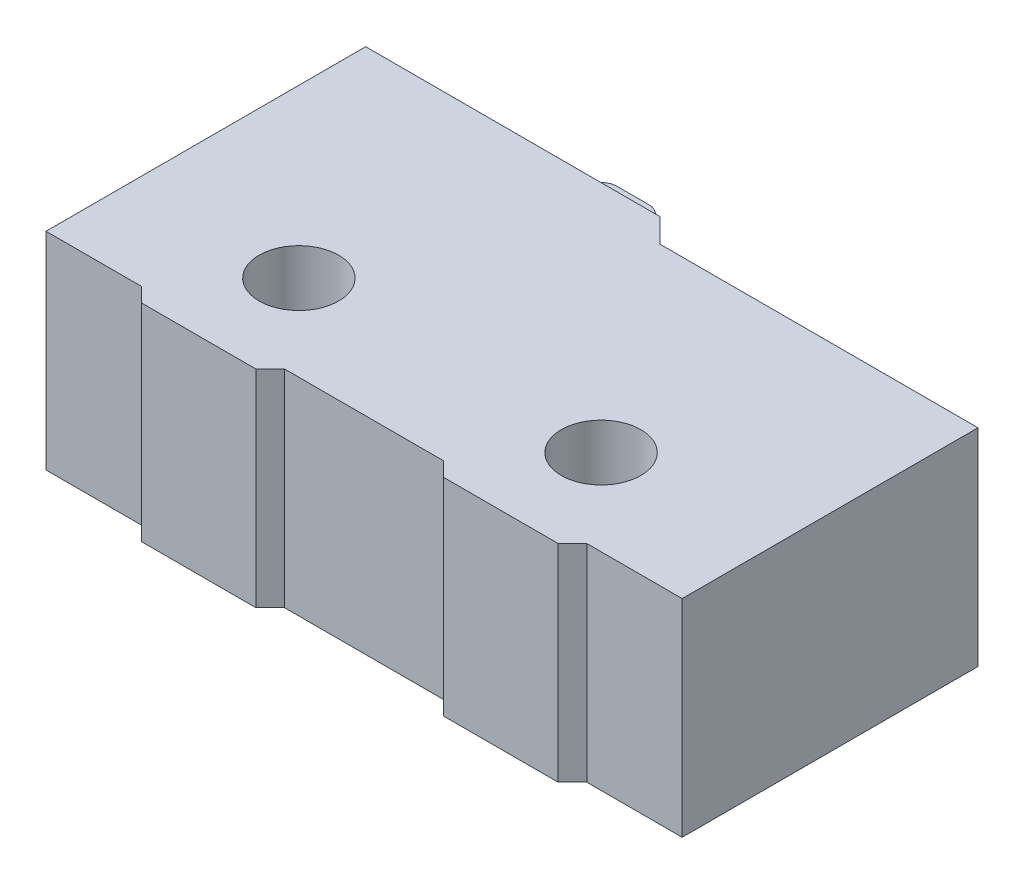
ISO-10303-21;
HEADER;
FILE_DESCRIPTION(('STEP AP214'),'2;1');
FILE_NAME('part.step','',(''),(''),'','','');
FILE_SCHEMA(('AUTOMOTIVE_DESIGN { 1 0 10303 214 1 1 1 1 }'));
ENDSEC;
DATA;
#1=APPLICATION_CONTEXT('core data for automotive mechanical design processes');
#2=APPLICATION_PROTOCOL_DEFINITION('international standard','automotive_design',2000,#1);
#3=PRODUCT_CONTEXT('',#1,'mechanical');
#4=PRODUCT('Part','Part','',(#3));
#5=PRODUCT_RELATED_PRODUCT_CATEGORY('part','',(#4));
#6=PRODUCT_DEFINITION_FORMATION('','',#4);
#7=PRODUCT_DEFINITION_CONTEXT('part definition',#1,'design');
#8=PRODUCT_DEFINITION('design','',#6,#7);
#9=PRODUCT_DEFINITION_SHAPE('','',#8);
#10=(LENGTH_UNIT() NAMED_UNIT(*) SI_UNIT(.MILLI.,.METRE.));
#11=(NAMED_UNIT(*) PLANE_ANGLE_UNIT() SI_UNIT($,.RADIAN.));
#12=(NAMED_UNIT(*) SI_UNIT($,.STERADIAN.) SOLID_ANGLE_UNIT());
#13=UNCERTAINTY_MEASURE_WITH_UNIT(LENGTH_MEASURE(1.E-05),#10,'distance_accuracy_value','');
#14=(GEOMETRIC_REPRESENTATION_CONTEXT(3) GLOBAL_UNCERTAINTY_ASSIGNED_CONTEXT((#13)) GLOBAL_UNIT_ASSIGNED_CONTEXT((#10,
#11,#12)) REPRESENTATION_CONTEXT('',''));
#15=CARTESIAN_POINT('',(0.,0.,0.));
#16=DIRECTION('',(0.,0.,1.));
#17=DIRECTION('',(1.,0.,0.));
#18=AXIS2_PLACEMENT_3D('',#15,#16,#17);
#19=CARTESIAN_POINT('',(-10.,6.5,5.25));
#20=DIRECTION('',(0.,0.,-1.));
#21=DIRECTION('',(-1.,0.,0.));
#22=AXIS2_PLACEMENT_3D('',#19,#20,#21);
#23=PLANE('',#22);
#24=DIRECTION('',(1.,0.,0.));
#25=VECTOR('',#24,1.);
#26=CARTESIAN_POINT('',(-10.,0.,5.25));
#27=LINE('',#26,#25);
#28=CARTESIAN_POINT('',(-6.55,0.,5.25));
#29=VERTEX_POINT('',#28);
#30=CARTESIAN_POINT('',(-2.95,0.,5.25));
#31=VERTEX_POINT('',#30);
#32=EDGE_CURVE('E275',#29,#31,#27,.T.);
#33=ORIENTED_EDGE('',*,*,#32,.T.);
#34=DIRECTION('',(0.,1.,0.));
#35=VECTOR('',#34,1.);
#36=CARTESIAN_POINT('',(-2.95,6.5,5.25));
#37=LINE('',#36,#35);
#38=CARTESIAN_POINT('',(-2.95,6.5,5.25));
#39=VERTEX_POINT('',#38);
#40=EDGE_CURVE('E312',#31,#39,#37,.T.);
#41=ORIENTED_EDGE('',*,*,#40,.T.);
#42=DIRECTION('',(1.,0.,0.));
#43=VECTOR('',#42,1.);
#44=CARTESIAN_POINT('',(-10.,6.5,5.25));
#45=LINE('',#44,#43);
#46=CARTESIAN_POINT('',(-6.55,6.5,5.25));
#47=VERTEX_POINT('',#46);
#48=EDGE_CURVE('E263',#47,#39,#45,.T.);
#49=ORIENTED_EDGE('',*,*,#48,.F.);
#50=DIRECTION('',(0.,-1.,0.));
#51=VECTOR('',#50,1.);
#52=CARTESIAN_POINT('',(-6.55,6.5,5.25));
#53=LINE('',#52,#51);
#54=EDGE_CURVE('E309',#47,#29,#53,.T.);
#55=ORIENTED_EDGE('',*,*,#54,.T.);
#56=EDGE_LOOP('',(#33,#41,#49,#55));
#57=FACE_BOUND('',#56,.T.);
#58=ADVANCED_FACE('F33',(#57),#23,.F.);
#59=CARTESIAN_POINT('',(-10.,6.5,-5.25));
#60=DIRECTION('',(1.,0.,0.));
#61=DIRECTION('',(0.,0.,-1.));
#62=AXIS2_PLACEMENT_3D('',#59,#60,#61);
#63=PLANE('',#62);
#64=DIRECTION('',(0.,0.,1.));
#65=VECTOR('',#64,1.);
#66=CARTESIAN_POINT('',(-10.,0.,-5.25));
#67=LINE('',#66,#65);
#68=CARTESIAN_POINT('',(-10.,0.,-5.25));
#69=VERTEX_POINT('',#68);
#70=CARTESIAN_POINT('',(-10.,0.,4.8));
#71=VERTEX_POINT('',#70);
#72=EDGE_CURVE('E255',#69,#71,#67,.T.);
#73=ORIENTED_EDGE('',*,*,#72,.T.);
#74=DIRECTION('',(0.,1.,0.));
#75=VECTOR('',#74,1.);
#76=CARTESIAN_POINT('',(-10.,6.5,4.8));
#77=LINE('',#76,#75);
#78=CARTESIAN_POINT('',(-10.,6.5,4.8));
#79=VERTEX_POINT('',#78);
#80=EDGE_CURVE('E242',#71,#79,#77,.T.);
#81=ORIENTED_EDGE('',*,*,#80,.T.);
#82=DIRECTION('',(0.,0.,1.));
#83=VECTOR('',#82,1.);
#84=CARTESIAN_POINT('',(-10.,6.5,-5.25));
#85=LINE('',#84,#83);
#86=CARTESIAN_POINT('',(-10.,6.5,-5.25));
#87=VERTEX_POINT('',#86);
#88=EDGE_CURVE('E258',#87,#79,#85,.T.);
#89=ORIENTED_EDGE('',*,*,#88,.F.);
#90=DIRECTION('',(0.,-1.,0.));
#91=VECTOR('',#90,1.);
#92=CARTESIAN_POINT('',(-10.,6.5,-5.25));
#93=LINE('',#92,#91);
#94=EDGE_CURVE('E271',#87,#69,#93,.T.);
#95=ORIENTED_EDGE('',*,*,#94,.T.);
#96=EDGE_LOOP('',(#73,#81,#89,#95));
#97=FACE_BOUND('',#96,.T.);
#98=ADVANCED_FACE('F361',(#97),#63,.F.);
#99=CARTESIAN_POINT('',(2.94999999999886,0.,5.25));
#100=VERTEX_POINT('',#99);
#101=CARTESIAN_POINT('',(6.55,0.,5.25));
#102=VERTEX_POINT('',#101);
#103=EDGE_CURVE('E274',#100,#102,#27,.T.);
#104=ORIENTED_EDGE('',*,*,#103,.T.);
#105=DIRECTION('',(0.,1.,0.));
#106=VECTOR('',#105,1.);
#107=CARTESIAN_POINT('',(6.55,6.5,5.25));
#108=LINE('',#107,#106);
#109=CARTESIAN_POINT('',(6.55,6.5,5.25));
#110=VERTEX_POINT('',#109);
#111=EDGE_CURVE('E290',#102,#110,#108,.T.);
#112=ORIENTED_EDGE('',*,*,#111,.T.);
#113=CARTESIAN_POINT('',(2.94999999999886,6.5,5.25));
#114=VERTEX_POINT('',#113);
#115=EDGE_CURVE('E261',#114,#110,#45,.T.);
#116=ORIENTED_EDGE('',*,*,#115,.F.);
#117=DIRECTION('',(0.,-1.,0.));
#118=VECTOR('',#117,1.);
#119=CARTESIAN_POINT('',(2.94999999999886,6.5,5.25));
#120=LINE('',#119,#118);
#121=EDGE_CURVE('E287',#114,#100,#120,.T.);
#122=ORIENTED_EDGE('',*,*,#121,.T.);
#123=EDGE_LOOP('',(#104,#112,#116,#122));
#124=FACE_BOUND('',#123,.T.);
#125=ADVANCED_FACE('F364',(#124),#23,.F.);
#126=CARTESIAN_POINT('',(10.,6.5,-5.25));
#127=DIRECTION('',(-1.,0.,0.));
#128=DIRECTION('',(0.,0.,1.));
#129=AXIS2_PLACEMENT_3D('',#126,#127,#128);
#130=PLANE('',#129);
#131=DIRECTION('',(0.,0.,-1.));
#132=VECTOR('',#131,1.);
#133=CARTESIAN_POINT('',(10.,0.,-5.25));
#134=LINE('',#133,#132);
#135=CARTESIAN_POINT('',(10.,0.,4.8));
#136=VERTEX_POINT('',#135);
#137=CARTESIAN_POINT('',(10.,0.,-4.5));
#138=VERTEX_POINT('',#137);
#139=EDGE_CURVE('E278',#136,#138,#134,.T.);
#140=ORIENTED_EDGE('',*,*,#139,.T.);
#141=DIRECTION('',(0.,1.,0.));
#142=VECTOR('',#141,1.);
#143=CARTESIAN_POINT('',(10.,6.5,-4.5));
#144=LINE('',#143,#142);
#145=CARTESIAN_POINT('',(10.,6.5,-4.5));
#146=VERTEX_POINT('',#145);
#147=EDGE_CURVE('E212',#138,#146,#144,.T.);
#148=ORIENTED_EDGE('',*,*,#147,.T.);
#149=DIRECTION('',(0.,0.,-1.));
#150=VECTOR('',#149,1.);
#151=CARTESIAN_POINT('',(10.,6.5,-5.25));
#152=LINE('',#151,#150);
#153=CARTESIAN_POINT('',(10.,6.5,4.8));
#154=VERTEX_POINT('',#153);
#155=EDGE_CURVE('E266',#154,#146,#152,.T.);
#156=ORIENTED_EDGE('',*,*,#155,.F.);
#157=DIRECTION('',(0.,-1.,0.));
#158=VECTOR('',#157,1.);
#159=CARTESIAN_POINT('',(10.,6.5,4.8));
#160=LINE('',#159,#158);
#161=EDGE_CURVE('E221',#154,#136,#160,.T.);
#162=ORIENTED_EDGE('',*,*,#161,.T.);
#163=EDGE_LOOP('',(#140,#148,#156,#162));
#164=FACE_BOUND('',#163,.T.);
#165=ADVANCED_FACE('F372',(#164),#130,.F.);
#166=CARTESIAN_POINT('',(-10.,6.5,-5.25));
#167=DIRECTION('',(0.,0.,1.));
#168=DIRECTION('',(1.,0.,0.));
#169=AXIS2_PLACEMENT_3D('',#166,#167,#168);
#170=PLANE('',#169);
#171=DIRECTION('',(0.,1.,0.));
#172=VECTOR('',#171,1.);
#173=CARTESIAN_POINT('',(-4.,1.25,-5.24999999999477));
#174=LINE('',#173,#172);
#175=CARTESIAN_POINT('',(-4.,1.25,-5.25));
#176=VERTEX_POINT('',#175);
#177=CARTESIAN_POINT('',(-4.,5.25,-5.25));
#178=VERTEX_POINT('',#177);
#179=EDGE_CURVE('E184',#176,#178,#174,.T.);
#180=ORIENTED_EDGE('',*,*,#179,.F.);
#181=DIRECTION('',(1.,0.,-2.61466195916604E-12));
#182=VECTOR('',#181,1.);
#183=CARTESIAN_POINT('',(-4.,1.25,-5.24999999999477));
#184=LINE('',#183,#182);
#185=CARTESIAN_POINT('',(-2.,1.25,-5.25));
#186=VERTEX_POINT('',#185);
#187=EDGE_CURVE('E179',#176,#186,#184,.T.);
#188=ORIENTED_EDGE('',*,*,#187,.T.);
#189=DIRECTION('',(0.,1.,0.));
#190=VECTOR('',#189,1.);
#191=CARTESIAN_POINT('',(-2.,1.25,-5.25));
#192=LINE('',#191,#190);
#193=CARTESIAN_POINT('',(-2.,5.25,-5.25));
#194=VERTEX_POINT('',#193);
#195=EDGE_CURVE('E170',#186,#194,#192,.T.);
#196=ORIENTED_EDGE('',*,*,#195,.T.);
#197=DIRECTION('',(1.,0.,-2.61466195916604E-12));
#198=VECTOR('',#197,1.);
#199=CARTESIAN_POINT('',(-4.,5.25,-5.24999999999477));
#200=LINE('',#199,#198);
#201=EDGE_CURVE('E176',#178,#194,#200,.T.);
#202=ORIENTED_EDGE('',*,*,#201,.F.);
#203=EDGE_LOOP('',(#180,#188,#196,#202));
#204=FACE_BOUND('',#203,.T.);
#205=DIRECTION('',(-1.,0.,0.));
#206=VECTOR('',#205,1.);
#207=CARTESIAN_POINT('',(-10.,6.5,-5.25));
#208=LINE('',#207,#206);
#209=CARTESIAN_POINT('',(-0.750000000000002,6.5,-5.25));
#210=VERTEX_POINT('',#209);
#211=EDGE_CURVE('E269',#210,#87,#208,.T.);
#212=ORIENTED_EDGE('',*,*,#211,.F.);
#213=DIRECTION('',(0.,-1.,0.));
#214=VECTOR('',#213,1.);
#215=CARTESIAN_POINT('',(-0.750000000000001,6.5,-5.25));
#216=LINE('',#215,#214);
#217=CARTESIAN_POINT('',(-0.750000000000001,0.,-5.25));
#218=VERTEX_POINT('',#217);
#219=EDGE_CURVE('E315',#210,#218,#216,.T.);
#220=ORIENTED_EDGE('',*,*,#219,.T.);
#221=DIRECTION('',(-1.,0.,0.));
#222=VECTOR('',#221,1.);
#223=CARTESIAN_POINT('',(-10.,0.,-5.25));
#224=LINE('',#223,#222);
#225=EDGE_CURVE('E262',#218,#69,#224,.T.);
#226=ORIENTED_EDGE('',*,*,#225,.T.);
#227=ORIENTED_EDGE('',*,*,#94,.F.);
#228=EDGE_LOOP('',(#212,#220,#226,#227));
#229=FACE_BOUND('',#228,.T.);
#230=ADVANCED_FACE('F173',(#204,#229),#170,.F.);
#231=CARTESIAN_POINT('',(0.,6.5,0.));
#232=DIRECTION('',(0.,1.,0.));
#233=DIRECTION('',(0.,0.,1.));
#234=AXIS2_PLACEMENT_3D('',#231,#232,#233);
#235=PLANE('',#234);
#236=DIRECTION('',(1.,0.,0.));
#237=VECTOR('',#236,1.);
#238=CARTESIAN_POINT('',(0.,6.5,-4.5));
#239=LINE('',#238,#237);
#240=CARTESIAN_POINT('',(0.,6.5,-4.5));
#241=VERTEX_POINT('',#240);
#242=EDGE_CURVE('E183',#241,#146,#239,.T.);
#243=ORIENTED_EDGE('',*,*,#242,.F.);
#244=DIRECTION('',(0.707106781186546,0.,0.707106781186549));
#245=VECTOR('',#244,1.);
#246=CARTESIAN_POINT('',(2.25,6.5,-2.24999999999998));
#247=LINE('',#246,#245);
#248=EDGE_CURVE('E320',#241,#210,#247,.F.);
#249=ORIENTED_EDGE('',*,*,#248,.T.);
#250=ORIENTED_EDGE('',*,*,#211,.T.);
#251=ORIENTED_EDGE('',*,*,#88,.T.);
#252=DIRECTION('',(-1.,0.,0.));
#253=VECTOR('',#252,1.);
#254=CARTESIAN_POINT('',(-11.4462653199894,6.5,4.8));
#255=LINE('',#254,#253);
#256=CARTESIAN_POINT('',(-7.,6.5,4.8));
#257=VERTEX_POINT('',#256);
#258=EDGE_CURVE('E234',#257,#79,#255,.T.);
#259=ORIENTED_EDGE('',*,*,#258,.F.);
#260=DIRECTION('',(-0.707106781186548,0.,-0.707106781186548));
#261=VECTOR('',#260,1.);
#262=CARTESIAN_POINT('',(-5.9,6.5,5.9));
#263=LINE('',#262,#261);
#264=EDGE_CURVE('E293',#257,#47,#263,.F.);
#265=ORIENTED_EDGE('',*,*,#264,.T.);
#266=ORIENTED_EDGE('',*,*,#48,.T.);
#267=DIRECTION('',(-0.707106781186548,0.,0.707106781186547));
#268=VECTOR('',#267,1.);
#269=CARTESIAN_POINT('',(1.15,6.5,1.15));
#270=LINE('',#269,#268);
#271=CARTESIAN_POINT('',(-2.5,6.5,4.79999999999441));
#272=VERTEX_POINT('',#271);
#273=EDGE_CURVE('E295',#39,#272,#270,.F.);
#274=ORIENTED_EDGE('',*,*,#273,.T.);
#275=DIRECTION('',(-1.,0.,0.));
#276=VECTOR('',#275,1.);
#277=CARTESIAN_POINT('',(-2.5,6.5,4.79999999999441));
#278=LINE('',#277,#276);
#279=CARTESIAN_POINT('',(2.49999999999886,6.5,4.79999999999441));
#280=VERTEX_POINT('',#279);
#281=EDGE_CURVE('E224',#280,#272,#278,.T.);
#282=ORIENTED_EDGE('',*,*,#281,.F.);
#283=DIRECTION('',(-0.707106781186548,0.,-0.707106781186548));
#284=VECTOR('',#283,1.);
#285=CARTESIAN_POINT('',(-1.15000000000057,6.5,1.15000000000057));
#286=LINE('',#285,#284);
#287=EDGE_CURVE('E297',#280,#114,#286,.F.);
#288=ORIENTED_EDGE('',*,*,#287,.T.);
#289=ORIENTED_EDGE('',*,*,#115,.T.);
#290=DIRECTION('',(-0.707106781186551,0.,0.707106781186544));
#291=VECTOR('',#290,1.);
#292=CARTESIAN_POINT('',(5.89999999999997,6.5,5.90000000000002));
#293=LINE('',#292,#291);
#294=CARTESIAN_POINT('',(7.,6.5,4.8));
#295=VERTEX_POINT('',#294);
#296=EDGE_CURVE('E299',#110,#295,#293,.F.);
#297=ORIENTED_EDGE('',*,*,#296,.T.);
#298=DIRECTION('',(-1.,0.,0.));
#299=VECTOR('',#298,1.);
#300=CARTESIAN_POINT('',(7.,6.5,4.8));
#301=LINE('',#300,#299);
#302=EDGE_CURVE('E215',#154,#295,#301,.T.);
#303=ORIENTED_EDGE('',*,*,#302,.F.);
#304=ORIENTED_EDGE('',*,*,#155,.T.);
#305=EDGE_LOOP('',(#243,#249,#250,#251,#259,#265,#266,#274,#282,#288,#289,#297,#303,#304));
#306=FACE_BOUND('',#305,.T.);
#307=CARTESIAN_POINT('',(4.75,6.5,2.1));
#308=DIRECTION('',(0.,1.,0.));
#309=DIRECTION('',(0.,0.,1.));
#310=AXIS2_PLACEMENT_3D('',#307,#308,#309);
#311=CIRCLE('',#310,1.25);
#312=CARTESIAN_POINT('',(4.75,6.5,3.35));
#313=VERTEX_POINT('',#312);
#314=EDGE_CURVE('E245',#313,#313,#311,.T.);
#315=ORIENTED_EDGE('',*,*,#314,.F.);
#316=EDGE_LOOP('',(#315));
#317=FACE_BOUND('',#316,.T.);
#318=CARTESIAN_POINT('',(-4.75,6.5,2.1));
#319=DIRECTION('',(0.,1.,0.));
#320=DIRECTION('',(0.,0.,1.));
#321=AXIS2_PLACEMENT_3D('',#318,#319,#320);
#322=CIRCLE('',#321,1.25);
#323=CARTESIAN_POINT('',(-4.75,6.5,3.35));
#324=VERTEX_POINT('',#323);
#325=EDGE_CURVE('E249',#324,#324,#322,.T.);
#326=ORIENTED_EDGE('',*,*,#325,.F.);
#327=EDGE_LOOP('',(#326));
#328=FACE_BOUND('',#327,.T.);
#329=ADVANCED_FACE('F391',(#306,#317,#328),#235,.T.);
#330=CARTESIAN_POINT('',(0.,0.,0.));
#331=DIRECTION('',(0.,1.,0.));
#332=DIRECTION('',(0.,0.,1.));
#333=AXIS2_PLACEMENT_3D('',#330,#331,#332);
#334=PLANE('',#333);
#335=CARTESIAN_POINT('',(4.75,0.,2.1));
#336=DIRECTION('',(0.,1.,0.));
#337=DIRECTION('',(0.,0.,1.));
#338=AXIS2_PLACEMENT_3D('',#335,#336,#337);
#339=CIRCLE('',#338,1.25);
#340=CARTESIAN_POINT('',(4.75,0.,3.35));
#341=VERTEX_POINT('',#340);
#342=EDGE_CURVE('E246',#341,#341,#339,.T.);
#343=ORIENTED_EDGE('',*,*,#342,.T.);
#344=EDGE_LOOP('',(#343));
#345=FACE_BOUND('',#344,.T.);
#346=CARTESIAN_POINT('',(-4.75,0.,2.1));
#347=DIRECTION('',(0.,1.,0.));
#348=DIRECTION('',(0.,0.,1.));
#349=AXIS2_PLACEMENT_3D('',#346,#347,#348);
#350=CIRCLE('',#349,1.25);
#351=CARTESIAN_POINT('',(-4.75,0.,3.35));
#352=VERTEX_POINT('',#351);
#353=EDGE_CURVE('E252',#352,#352,#350,.T.);
#354=ORIENTED_EDGE('',*,*,#353,.T.);
#355=EDGE_LOOP('',(#354));
#356=FACE_BOUND('',#355,.T.);
#357=ORIENTED_EDGE('',*,*,#225,.F.);
#358=DIRECTION('',(-0.707106781186546,0.,-0.707106781186549));
#359=VECTOR('',#358,1.);
#360=CARTESIAN_POINT('',(-0.750000000000001,0.,-5.25));
#361=LINE('',#360,#359);
#362=CARTESIAN_POINT('',(0.,0.,-4.5));
#363=VERTEX_POINT('',#362);
#364=EDGE_CURVE('E318',#218,#363,#361,.F.);
#365=ORIENTED_EDGE('',*,*,#364,.T.);
#366=DIRECTION('',(1.,0.,0.));
#367=VECTOR('',#366,1.);
#368=CARTESIAN_POINT('',(0.,0.,-4.5));
#369=LINE('',#368,#367);
#370=EDGE_CURVE('E206',#363,#138,#369,.T.);
#371=ORIENTED_EDGE('',*,*,#370,.T.);
#372=ORIENTED_EDGE('',*,*,#139,.F.);
#373=DIRECTION('',(-1.,0.,0.));
#374=VECTOR('',#373,1.);
#375=CARTESIAN_POINT('',(0.,0.,4.8));
#376=LINE('',#375,#374);
#377=CARTESIAN_POINT('',(7.,0.,4.8));
#378=VERTEX_POINT('',#377);
#379=EDGE_CURVE('E284',#136,#378,#376,.T.);
#380=ORIENTED_EDGE('',*,*,#379,.T.);
#381=DIRECTION('',(0.707106781186551,0.,-0.707106781186544));
#382=VECTOR('',#381,1.);
#383=CARTESIAN_POINT('',(6.55,0.,5.25));
#384=LINE('',#383,#382);
#385=EDGE_CURVE('E307',#378,#102,#384,.F.);
#386=ORIENTED_EDGE('',*,*,#385,.T.);
#387=ORIENTED_EDGE('',*,*,#103,.F.);
#388=DIRECTION('',(0.707106781186548,0.,0.707106781186548));
#389=VECTOR('',#388,1.);
#390=CARTESIAN_POINT('',(2.94999999999886,0.,5.25));
#391=LINE('',#390,#389);
#392=CARTESIAN_POINT('',(2.49999999999886,0.,4.79999999999441));
#393=VERTEX_POINT('',#392);
#394=EDGE_CURVE('E305',#100,#393,#391,.F.);
#395=ORIENTED_EDGE('',*,*,#394,.T.);
#396=DIRECTION('',(-1.,0.,0.));
#397=VECTOR('',#396,1.);
#398=CARTESIAN_POINT('',(-2.5,0.,4.79999999999441));
#399=LINE('',#398,#397);
#400=CARTESIAN_POINT('',(-2.5,0.,4.79999999999441));
#401=VERTEX_POINT('',#400);
#402=EDGE_CURVE('E225',#393,#401,#399,.T.);
#403=ORIENTED_EDGE('',*,*,#402,.T.);
#404=DIRECTION('',(0.707106781186548,0.,-0.707106781186547));
#405=VECTOR('',#404,1.);
#406=CARTESIAN_POINT('',(-2.95,0.,5.25));
#407=LINE('',#406,#405);
#408=EDGE_CURVE('E303',#401,#31,#407,.F.);
#409=ORIENTED_EDGE('',*,*,#408,.T.);
#410=ORIENTED_EDGE('',*,*,#32,.F.);
#411=DIRECTION('',(0.707106781186548,0.,0.707106781186548));
#412=VECTOR('',#411,1.);
#413=CARTESIAN_POINT('',(-6.55,0.,5.25));
#414=LINE('',#413,#412);
#415=CARTESIAN_POINT('',(-7.,0.,4.8));
#416=VERTEX_POINT('',#415);
#417=EDGE_CURVE('E301',#29,#416,#414,.F.);
#418=ORIENTED_EDGE('',*,*,#417,.T.);
#419=DIRECTION('',(-1.,0.,0.));
#420=VECTOR('',#419,1.);
#421=CARTESIAN_POINT('',(-11.4462653199894,0.,4.8));
#422=LINE('',#421,#420);
#423=EDGE_CURVE('E236',#416,#71,#422,.T.);
#424=ORIENTED_EDGE('',*,*,#423,.T.);
#425=ORIENTED_EDGE('',*,*,#72,.F.);
#426=EDGE_LOOP('',(#357,#365,#371,#372,#380,#386,#387,#395,#403,#409,#410,#418,#424,#425));
#427=FACE_BOUND('',#426,.T.);
#428=ADVANCED_FACE('F398',(#345,#356,#427),#334,.F.);
#429=CARTESIAN_POINT('',(-4.75,0.,2.1));
#430=DIRECTION('',(0.,1.,0.));
#431=DIRECTION('',(0.,0.,1.));
#432=AXIS2_PLACEMENT_3D('',#429,#430,#431);
#433=CYLINDRICAL_SURFACE('',#432,1.25);
#434=CARTESIAN_POINT('',(-4.75,0.,3.35));
#435=CARTESIAN_POINT('',(-4.75,0.0677083333333332,3.35));
#436=CARTESIAN_POINT('',(-4.75,0.135416666666667,3.35));
#437=CARTESIAN_POINT('',(-4.75,0.270833333333333,3.35));
#438=CARTESIAN_POINT('',(-4.75,0.338541666666667,3.35));
#439=CARTESIAN_POINT('',(-4.75,0.473958333333333,3.35));
#440=CARTESIAN_POINT('',(-4.75,0.541666666666667,3.35));
#441=CARTESIAN_POINT('',(-4.75,0.677083333333333,3.35));
#442=CARTESIAN_POINT('',(-4.75,0.744791666666667,3.35));
#443=CARTESIAN_POINT('',(-4.75,0.880208333333333,3.35));
#444=CARTESIAN_POINT('',(-4.75,0.947916666666667,3.35));
#445=CARTESIAN_POINT('',(-4.75,1.08333333333333,3.35));
#446=CARTESIAN_POINT('',(-4.75,1.15104166666667,3.35));
#447=CARTESIAN_POINT('',(-4.75,1.28645833333333,3.35));
#448=CARTESIAN_POINT('',(-4.75,1.35416666666667,3.35));
#449=CARTESIAN_POINT('',(-4.75,1.48958333333333,3.35));
#450=CARTESIAN_POINT('',(-4.75,1.55729166666667,3.35));
#451=CARTESIAN_POINT('',(-4.75,1.69270833333333,3.35));
#452=CARTESIAN_POINT('',(-4.75,1.76041666666667,3.35));
#453=CARTESIAN_POINT('',(-4.75,1.89583333333333,3.35));
#454=CARTESIAN_POINT('',(-4.75,1.96354166666667,3.35));
#455=CARTESIAN_POINT('',(-4.75,2.09895833333333,3.35));
#456=CARTESIAN_POINT('',(-4.75,2.16666666666667,3.35));
#457=CARTESIAN_POINT('',(-4.75,2.30208333333333,3.35));
#458=CARTESIAN_POINT('',(-4.75,2.36979166666667,3.35));
#459=CARTESIAN_POINT('',(-4.75,2.50520833333333,3.35));
#460=CARTESIAN_POINT('',(-4.75,2.57291666666667,3.35));
#461=CARTESIAN_POINT('',(-4.75,2.70833333333333,3.35));
#462=CARTESIAN_POINT('',(-4.75,2.77604166666667,3.35));
#463=CARTESIAN_POINT('',(-4.75,2.91145833333333,3.35));
#464=CARTESIAN_POINT('',(-4.75,2.97916666666667,3.35));
#465=CARTESIAN_POINT('',(-4.75,3.11458333333333,3.35));
#466=CARTESIAN_POINT('',(-4.75,3.18229166666667,3.35));
#467=CARTESIAN_POINT('',(-4.75,3.31770833333333,3.35));
#468=CARTESIAN_POINT('',(-4.75,3.38541666666667,3.35));
#469=CARTESIAN_POINT('',(-4.75,3.52083333333333,3.35));
#470=CARTESIAN_POINT('',(-4.75,3.58854166666667,3.35));
#471=CARTESIAN_POINT('',(-4.75,3.72395833333333,3.35));
#472=CARTESIAN_POINT('',(-4.75,3.79166666666667,3.35));
#473=CARTESIAN_POINT('',(-4.75,3.92708333333333,3.35));
#474=CARTESIAN_POINT('',(-4.75,3.99479166666667,3.35));
#475=CARTESIAN_POINT('',(-4.75,4.13020833333333,3.35));
#476=CARTESIAN_POINT('',(-4.75,4.19791666666667,3.35));
#477=CARTESIAN_POINT('',(-4.75,4.33333333333333,3.35));
#478=CARTESIAN_POINT('',(-4.75,4.40104166666667,3.35));
#479=CARTESIAN_POINT('',(-4.75,4.53645833333333,3.35));
#480=CARTESIAN_POINT('',(-4.75,4.60416666666667,3.35));
#481=CARTESIAN_POINT('',(-4.75,4.73958333333333,3.35));
#482=CARTESIAN_POINT('',(-4.75,4.80729166666667,3.35));
#483=CARTESIAN_POINT('',(-4.75,4.94270833333333,3.35));
#484=CARTESIAN_POINT('',(-4.75,5.01041666666667,3.35));
#485=CARTESIAN_POINT('',(-4.75,5.14583333333333,3.35));
#486=CARTESIAN_POINT('',(-4.75,5.21354166666667,3.35));
#487=CARTESIAN_POINT('',(-4.75,5.34895833333333,3.35));
#488=CARTESIAN_POINT('',(-4.75,5.41666666666667,3.35));
#489=CARTESIAN_POINT('',(-4.75,5.55208333333333,3.35));
#490=CARTESIAN_POINT('',(-4.75,5.61979166666667,3.35));
#491=CARTESIAN_POINT('',(-4.75,5.75520833333333,3.35));
#492=CARTESIAN_POINT('',(-4.75,5.82291666666667,3.35));
#493=CARTESIAN_POINT('',(-4.75,5.95833333333333,3.35));
#494=CARTESIAN_POINT('',(-4.75,6.02604166666667,3.35));
#495=CARTESIAN_POINT('',(-4.75,6.16145833333333,3.35));
#496=CARTESIAN_POINT('',(-4.75,6.22916666666667,3.35));
#497=CARTESIAN_POINT('',(-4.75,6.36458333333333,3.35));
#498=CARTESIAN_POINT('',(-4.75,6.43229166666667,3.35));
#499=CARTESIAN_POINT('',(-4.75,6.5,3.35));
#500=B_SPLINE_CURVE_WITH_KNOTS('',3,(#434,#435,#436,#437,#438,#439,#440,#441,#442,#443,#444,
#445,#446,#447,#448,#449,#450,#451,#452,#453,#454,#455,#456,#457,#458,#459,#460,#461,#462,#463,
#464,#465,#466,#467,#468,#469,#470,#471,#472,#473,#474,#475,#476,#477,#478,#479,#480,#481,#482,
#483,#484,#485,#486,#487,#488,#489,#490,#491,#492,#493,#494,#495,#496,#497,#498,#499),
.UNSPECIFIED.,.F.,.F.,(4,2,2,2,2,2,2,2,2,2,2,2,2,2,2,2,2,2,2,2,2,2,2,2,2,2,2,2,2,2,2,2,4),(0.,
0.203125,0.40625,0.609375,0.8125,1.015625,1.21875,1.421875,1.625,1.828125,2.03125,2.234375,
2.4375,2.640625,2.84375,3.046875,3.25,3.453125,3.65625,3.859375,4.0625,4.265625,4.46875,
4.671875,4.875,5.078125,5.28125,5.484375,5.6875,5.890625,6.09375,6.296875,6.5),.UNSPECIFIED.);
#501=EDGE_CURVE('BSEAM554',#352,#324,#500,.T.);
#502=ORIENTED_EDGE('',*,*,#353,.F.);
#503=ORIENTED_EDGE('',*,*,#325,.T.);
#504=ORIENTED_EDGE('',*,*,#501,.T.);
#505=ORIENTED_EDGE('',*,*,#501,.F.);
#506=EDGE_LOOP('',(#502,#504,#503,#505));
#507=FACE_BOUND('',#506,.T.);
#508=ADVANCED_FACE('F554',(#507),#433,.F.);
#509=CARTESIAN_POINT('',(4.75,0.,2.1));
#510=DIRECTION('',(0.,1.,0.));
#511=DIRECTION('',(0.,0.,1.));
#512=AXIS2_PLACEMENT_3D('',#509,#510,#511);
#513=CYLINDRICAL_SURFACE('',#512,1.25);
#514=CARTESIAN_POINT('',(4.75,0.,3.35));
#515=CARTESIAN_POINT('',(4.75,0.0677083333333332,3.35));
#516=CARTESIAN_POINT('',(4.75,0.135416666666667,3.35));
#517=CARTESIAN_POINT('',(4.75,0.270833333333333,3.35));
#518=CARTESIAN_POINT('',(4.75,0.338541666666667,3.35));
#519=CARTESIAN_POINT('',(4.75,0.473958333333333,3.35));
#520=CARTESIAN_POINT('',(4.75,0.541666666666667,3.35));
#521=CARTESIAN_POINT('',(4.75,0.677083333333333,3.35));
#522=CARTESIAN_POINT('',(4.75,0.744791666666667,3.35));
#523=CARTESIAN_POINT('',(4.75,0.880208333333333,3.35));
#524=CARTESIAN_POINT('',(4.75,0.947916666666667,3.35));
#525=CARTESIAN_POINT('',(4.75,1.08333333333333,3.35));
#526=CARTESIAN_POINT('',(4.75,1.15104166666667,3.35));
#527=CARTESIAN_POINT('',(4.75,1.28645833333333,3.35));
#528=CARTESIAN_POINT('',(4.75,1.35416666666667,3.35));
#529=CARTESIAN_POINT('',(4.75,1.48958333333333,3.35));
#530=CARTESIAN_POINT('',(4.75,1.55729166666667,3.35));
#531=CARTESIAN_POINT('',(4.75,1.69270833333333,3.35));
#532=CARTESIAN_POINT('',(4.75,1.76041666666667,3.35));
#533=CARTESIAN_POINT('',(4.75,1.89583333333333,3.35));
#534=CARTESIAN_POINT('',(4.75,1.96354166666667,3.35));
#535=CARTESIAN_POINT('',(4.75,2.09895833333333,3.35));
#536=CARTESIAN_POINT('',(4.75,2.16666666666667,3.35));
#537=CARTESIAN_POINT('',(4.75,2.30208333333333,3.35));
#538=CARTESIAN_POINT('',(4.75,2.36979166666667,3.35));
#539=CARTESIAN_POINT('',(4.75,2.50520833333333,3.35));
#540=CARTESIAN_POINT('',(4.75,2.57291666666667,3.35));
#541=CARTESIAN_POINT('',(4.75,2.70833333333333,3.35));
#542=CARTESIAN_POINT('',(4.75,2.77604166666667,3.35));
#543=CARTESIAN_POINT('',(4.75,2.91145833333333,3.35));
#544=CARTESIAN_POINT('',(4.75,2.97916666666667,3.35));
#545=CARTESIAN_POINT('',(4.75,3.11458333333333,3.35));
#546=CARTESIAN_POINT('',(4.75,3.18229166666667,3.35));
#547=CARTESIAN_POINT('',(4.75,3.31770833333333,3.35));
#548=CARTESIAN_POINT('',(4.75,3.38541666666667,3.35));
#549=CARTESIAN_POINT('',(4.75,3.52083333333333,3.35));
#550=CARTESIAN_POINT('',(4.75,3.58854166666667,3.35));
#551=CARTESIAN_POINT('',(4.75,3.72395833333333,3.35));
#552=CARTESIAN_POINT('',(4.75,3.79166666666667,3.35));
#553=CARTESIAN_POINT('',(4.75,3.92708333333333,3.35));
#554=CARTESIAN_POINT('',(4.75,3.99479166666667,3.35));
#555=CARTESIAN_POINT('',(4.75,4.13020833333333,3.35));
#556=CARTESIAN_POINT('',(4.75,4.19791666666667,3.35));
#557=CARTESIAN_POINT('',(4.75,4.33333333333333,3.35));
#558=CARTESIAN_POINT('',(4.75,4.40104166666667,3.35));
#559=CARTESIAN_POINT('',(4.75,4.53645833333333,3.35));
#560=CARTESIAN_POINT('',(4.75,4.60416666666667,3.35));
#561=CARTESIAN_POINT('',(4.75,4.73958333333333,3.35));
#562=CARTESIAN_POINT('',(4.75,4.80729166666667,3.35));
#563=CARTESIAN_POINT('',(4.75,4.94270833333333,3.35));
#564=CARTESIAN_POINT('',(4.75,5.01041666666667,3.35));
#565=CARTESIAN_POINT('',(4.75,5.14583333333333,3.35));
#566=CARTESIAN_POINT('',(4.75,5.21354166666667,3.35));
#567=CARTESIAN_POINT('',(4.75,5.34895833333333,3.35));
#568=CARTESIAN_POINT('',(4.75,5.41666666666667,3.35));
#569=CARTESIAN_POINT('',(4.75,5.55208333333333,3.35));
#570=CARTESIAN_POINT('',(4.75,5.61979166666667,3.35));
#571=CARTESIAN_POINT('',(4.75,5.75520833333333,3.35));
#572=CARTESIAN_POINT('',(4.75,5.82291666666667,3.35));
#573=CARTESIAN_POINT('',(4.75,5.95833333333333,3.35));
#574=CARTESIAN_POINT('',(4.75,6.02604166666667,3.35));
#575=CARTESIAN_POINT('',(4.75,6.16145833333333,3.35));
#576=CARTESIAN_POINT('',(4.75,6.22916666666667,3.35));
#577=CARTESIAN_POINT('',(4.75,6.36458333333333,3.35));
#578=CARTESIAN_POINT('',(4.75,6.43229166666667,3.35));
#579=CARTESIAN_POINT('',(4.75,6.5,3.35));
#580=B_SPLINE_CURVE_WITH_KNOTS('',3,(#514,#515,#516,#517,#518,#519,#520,#521,#522,#523,#524,
#525,#526,#527,#528,#529,#530,#531,#532,#533,#534,#535,#536,#537,#538,#539,#540,#541,#542,#543,
#544,#545,#546,#547,#548,#549,#550,#551,#552,#553,#554,#555,#556,#557,#558,#559,#560,#561,#562,
#563,#564,#565,#566,#567,#568,#569,#570,#571,#572,#573,#574,#575,#576,#577,#578,#579),
.UNSPECIFIED.,.F.,.F.,(4,2,2,2,2,2,2,2,2,2,2,2,2,2,2,2,2,2,2,2,2,2,2,2,2,2,2,2,2,2,2,2,4),(0.,
0.203125,0.40625,0.609375,0.8125,1.015625,1.21875,1.421875,1.625,1.828125,2.03125,2.234375,
2.4375,2.640625,2.84375,3.046875,3.25,3.453125,3.65625,3.859375,4.0625,4.265625,4.46875,
4.671875,4.875,5.078125,5.28125,5.484375,5.6875,5.890625,6.09375,6.296875,6.5),.UNSPECIFIED.);
#581=EDGE_CURVE('BSEAM541',#341,#313,#580,.T.);
#582=ORIENTED_EDGE('',*,*,#342,.F.);
#583=ORIENTED_EDGE('',*,*,#314,.T.);
#584=ORIENTED_EDGE('',*,*,#581,.T.);
#585=ORIENTED_EDGE('',*,*,#581,.F.);
#586=EDGE_LOOP('',(#582,#584,#583,#585));
#587=FACE_BOUND('',#586,.T.);
#588=ADVANCED_FACE('F541',(#587),#513,.F.);
#589=CARTESIAN_POINT('',(-11.4462653199894,0.,4.8));
#590=DIRECTION('',(0.,0.,-1.));
#591=DIRECTION('',(-1.,0.,0.));
#592=AXIS2_PLACEMENT_3D('',#589,#590,#591);
#593=PLANE('',#592);
#594=ORIENTED_EDGE('',*,*,#423,.F.);
#595=DIRECTION('',(0.,1.,0.));
#596=VECTOR('',#595,1.);
#597=CARTESIAN_POINT('',(-7.,0.,4.8));
#598=LINE('',#597,#596);
#599=EDGE_CURVE('E239',#416,#257,#598,.T.);
#600=ORIENTED_EDGE('',*,*,#599,.T.);
#601=ORIENTED_EDGE('',*,*,#258,.T.);
#602=ORIENTED_EDGE('',*,*,#80,.F.);
#603=EDGE_LOOP('',(#594,#600,#601,#602));
#604=FACE_BOUND('',#603,.T.);
#605=ADVANCED_FACE('F533',(#604),#593,.F.);
#606=CARTESIAN_POINT('',(-2.5,0.,4.79999999999441));
#607=DIRECTION('',(0.,0.,-1.));
#608=DIRECTION('',(-1.,0.,0.));
#609=AXIS2_PLACEMENT_3D('',#606,#607,#608);
#610=PLANE('',#609);
#611=ORIENTED_EDGE('',*,*,#281,.T.);
#612=DIRECTION('',(0.,1.,0.));
#613=VECTOR('',#612,1.);
#614=CARTESIAN_POINT('',(-2.5,0.,4.79999999999441));
#615=LINE('',#614,#613);
#616=EDGE_CURVE('E231',#401,#272,#615,.T.);
#617=ORIENTED_EDGE('',*,*,#616,.F.);
#618=ORIENTED_EDGE('',*,*,#402,.F.);
#619=DIRECTION('',(0.,1.,0.));
#620=VECTOR('',#619,1.);
#621=CARTESIAN_POINT('',(2.49999999999886,0.,4.79999999999441));
#622=LINE('',#621,#620);
#623=EDGE_CURVE('E228',#393,#280,#622,.T.);
#624=ORIENTED_EDGE('',*,*,#623,.T.);
#625=EDGE_LOOP('',(#611,#617,#618,#624));
#626=FACE_BOUND('',#625,.T.);
#627=ADVANCED_FACE('F426',(#626),#610,.F.);
#628=CARTESIAN_POINT('',(7.,0.,4.8));
#629=DIRECTION('',(0.,0.,-1.));
#630=DIRECTION('',(-1.,0.,0.));
#631=AXIS2_PLACEMENT_3D('',#628,#629,#630);
#632=PLANE('',#631);
#633=ORIENTED_EDGE('',*,*,#302,.T.);
#634=DIRECTION('',(0.,1.,0.));
#635=VECTOR('',#634,1.);
#636=CARTESIAN_POINT('',(7.,0.,4.8));
#637=LINE('',#636,#635);
#638=EDGE_CURVE('E218',#378,#295,#637,.T.);
#639=ORIENTED_EDGE('',*,*,#638,.F.);
#640=ORIENTED_EDGE('',*,*,#379,.F.);
#641=ORIENTED_EDGE('',*,*,#161,.F.);
#642=EDGE_LOOP('',(#633,#639,#640,#641));
#643=FACE_BOUND('',#642,.T.);
#644=ADVANCED_FACE('F395',(#643),#632,.F.);
#645=CARTESIAN_POINT('',(6.55,6.5,5.25));
#646=DIRECTION('',(-0.707106781186544,0.,-0.707106781186551));
#647=DIRECTION('',(0.,1.,0.));
#648=AXIS2_PLACEMENT_3D('',#645,#646,#647);
#649=PLANE('',#648);
#650=ORIENTED_EDGE('',*,*,#385,.F.);
#651=ORIENTED_EDGE('',*,*,#638,.T.);
#652=ORIENTED_EDGE('',*,*,#296,.F.);
#653=ORIENTED_EDGE('',*,*,#111,.F.);
#654=EDGE_LOOP('',(#650,#651,#652,#653));
#655=FACE_BOUND('',#654,.T.);
#656=ADVANCED_FACE('F387',(#655),#649,.F.);
#657=CARTESIAN_POINT('',(2.94999999999886,6.5,5.25));
#658=DIRECTION('',(0.707106781186548,0.,-0.707106781186548));
#659=DIRECTION('',(0.,-1.,0.));
#660=AXIS2_PLACEMENT_3D('',#657,#658,#659);
#661=PLANE('',#660);
#662=ORIENTED_EDGE('',*,*,#287,.F.);
#663=ORIENTED_EDGE('',*,*,#623,.F.);
#664=ORIENTED_EDGE('',*,*,#394,.F.);
#665=ORIENTED_EDGE('',*,*,#121,.F.);
#666=EDGE_LOOP('',(#662,#663,#664,#665));
#667=FACE_BOUND('',#666,.T.);
#668=ADVANCED_FACE('F429',(#667),#661,.F.);
#669=CARTESIAN_POINT('',(-2.95,6.5,5.25));
#670=DIRECTION('',(-0.707106781186547,0.,-0.707106781186548));
#671=DIRECTION('',(0.,1.,0.));
#672=AXIS2_PLACEMENT_3D('',#669,#670,#671);
#673=PLANE('',#672);
#674=ORIENTED_EDGE('',*,*,#408,.F.);
#675=ORIENTED_EDGE('',*,*,#616,.T.);
#676=ORIENTED_EDGE('',*,*,#273,.F.);
#677=ORIENTED_EDGE('',*,*,#40,.F.);
#678=EDGE_LOOP('',(#674,#675,#676,#677));
#679=FACE_BOUND('',#678,.T.);
#680=ADVANCED_FACE('F422',(#679),#673,.F.);
#681=CARTESIAN_POINT('',(-6.55,6.5,5.25));
#682=DIRECTION('',(0.707106781186548,0.,-0.707106781186548));
#683=DIRECTION('',(0.,-1.,0.));
#684=AXIS2_PLACEMENT_3D('',#681,#682,#683);
#685=PLANE('',#684);
#686=ORIENTED_EDGE('',*,*,#264,.F.);
#687=ORIENTED_EDGE('',*,*,#599,.F.);
#688=ORIENTED_EDGE('',*,*,#417,.F.);
#689=ORIENTED_EDGE('',*,*,#54,.F.);
#690=EDGE_LOOP('',(#686,#687,#688,#689));
#691=FACE_BOUND('',#690,.T.);
#692=ADVANCED_FACE('F415',(#691),#685,.F.);
#693=CARTESIAN_POINT('',(0.,0.,-4.5));
#694=DIRECTION('',(0.,0.,1.));
#695=DIRECTION('',(1.,0.,0.));
#696=AXIS2_PLACEMENT_3D('',#693,#694,#695);
#697=PLANE('',#696);
#698=ORIENTED_EDGE('',*,*,#370,.F.);
#699=DIRECTION('',(0.,1.,0.));
#700=VECTOR('',#699,1.);
#701=CARTESIAN_POINT('',(0.,0.,-4.5));
#702=LINE('',#701,#700);
#703=EDGE_CURVE('E209',#363,#241,#702,.T.);
#704=ORIENTED_EDGE('',*,*,#703,.T.);
#705=ORIENTED_EDGE('',*,*,#242,.T.);
#706=ORIENTED_EDGE('',*,*,#147,.F.);
#707=EDGE_LOOP('',(#698,#704,#705,#706));
#708=FACE_BOUND('',#707,.T.);
#709=ADVANCED_FACE('F355',(#708),#697,.F.);
#710=CARTESIAN_POINT('',(-0.750000000000001,6.5,-5.25));
#711=DIRECTION('',(-0.707106781186549,0.,0.707106781186546));
#712=DIRECTION('',(0.,-1.,0.));
#713=AXIS2_PLACEMENT_3D('',#710,#711,#712);
#714=PLANE('',#713);
#715=ORIENTED_EDGE('',*,*,#248,.F.);
#716=ORIENTED_EDGE('',*,*,#703,.F.);
#717=ORIENTED_EDGE('',*,*,#364,.F.);
#718=ORIENTED_EDGE('',*,*,#219,.F.);
#719=EDGE_LOOP('',(#715,#716,#717,#718));
#720=FACE_BOUND('',#719,.T.);
#721=ADVANCED_FACE('F348',(#720),#714,.F.);
#722=CARTESIAN_POINT('',(-4.,1.25,-5.24999999999477));
#723=DIRECTION('',(-1.,0.,0.));
#724=DIRECTION('',(0.,0.,1.));
#725=AXIS2_PLACEMENT_3D('',#722,#723,#724);
#726=PLANE('',#725);
#727=DIRECTION('',(0.,0.,1.));
#728=VECTOR('',#727,1.);
#729=CARTESIAN_POINT('',(-4.,5.25,-5.24999999999477));
#730=LINE('',#729,#728);
#731=CARTESIAN_POINT('',(-4.,5.25,-6.15));
#732=VERTEX_POINT('',#731);
#733=EDGE_CURVE('E196',#732,#178,#730,.T.);
#734=ORIENTED_EDGE('',*,*,#733,.F.);
#735=DIRECTION('',(0.,1.,0.));
#736=VECTOR('',#735,1.);
#737=CARTESIAN_POINT('',(-4.,1.25,-6.15));
#738=LINE('',#737,#736);
#739=CARTESIAN_POINT('',(-4.,1.25,-6.15));
#740=VERTEX_POINT('',#739);
#741=EDGE_CURVE('E11',#732,#740,#738,.F.);
#742=ORIENTED_EDGE('',*,*,#741,.T.);
#743=DIRECTION('',(0.,0.,1.));
#744=VECTOR('',#743,1.);
#745=CARTESIAN_POINT('',(-4.,1.25,-5.24999999999477));
#746=LINE('',#745,#744);
#747=EDGE_CURVE('E202',#740,#176,#746,.T.);
#748=ORIENTED_EDGE('',*,*,#747,.T.);
#749=ORIENTED_EDGE('',*,*,#179,.T.);
#750=EDGE_LOOP('',(#734,#742,#748,#749));
#751=FACE_BOUND('',#750,.T.);
#752=ADVANCED_FACE('F344',(#751),#726,.T.);
#753=CARTESIAN_POINT('',(-4.,1.25,-6.65));
#754=DIRECTION('',(0.,0.,-1.));
#755=DIRECTION('',(-1.,0.,0.));
#756=AXIS2_PLACEMENT_3D('',#753,#754,#755);
#757=PLANE('',#756);
#758=DIRECTION('',(-1.,0.,0.));
#759=VECTOR('',#758,1.);
#760=CARTESIAN_POINT('',(-4.,5.25,-6.65));
#761=LINE('',#760,#759);
#762=CARTESIAN_POINT('',(-2.5,5.25,-6.65));
#763=VERTEX_POINT('',#762);
#764=CARTESIAN_POINT('',(-3.5,5.25,-6.65));
#765=VERTEX_POINT('',#764);
#766=EDGE_CURVE('E193',#763,#765,#761,.T.);
#767=ORIENTED_EDGE('',*,*,#766,.F.);
#768=DIRECTION('',(0.,1.,0.));
#769=VECTOR('',#768,1.);
#770=CARTESIAN_POINT('',(-2.5,1.25,-6.65));
#771=LINE('',#770,#769);
#772=CARTESIAN_POINT('',(-2.5,1.25,-6.65));
#773=VERTEX_POINT('',#772);
#774=EDGE_CURVE('E330',#763,#773,#771,.F.);
#775=ORIENTED_EDGE('',*,*,#774,.T.);
#776=DIRECTION('',(-1.,0.,0.));
#777=VECTOR('',#776,1.);
#778=CARTESIAN_POINT('',(-4.,1.25,-6.65));
#779=LINE('',#778,#777);
#780=CARTESIAN_POINT('',(-3.5,1.25,-6.65));
#781=VERTEX_POINT('',#780);
#782=EDGE_CURVE('E205',#773,#781,#779,.T.);
#783=ORIENTED_EDGE('',*,*,#782,.T.);
#784=DIRECTION('',(0.,1.,0.));
#785=VECTOR('',#784,1.);
#786=CARTESIAN_POINT('',(-3.5,1.25,-6.65));
#787=LINE('',#786,#785);
#788=EDGE_CURVE('E327',#781,#765,#787,.T.);
#789=ORIENTED_EDGE('',*,*,#788,.T.);
#790=EDGE_LOOP('',(#767,#775,#783,#789));
#791=FACE_BOUND('',#790,.T.);
#792=ADVANCED_FACE('F341',(#791),#757,.T.);
#793=CARTESIAN_POINT('',(-2.,1.25,-5.25));
#794=DIRECTION('',(1.,0.,0.));
#795=DIRECTION('',(0.,0.,-1.));
#796=AXIS2_PLACEMENT_3D('',#793,#794,#795);
#797=PLANE('',#796);
#798=DIRECTION('',(0.,0.,-1.));
#799=VECTOR('',#798,1.);
#800=CARTESIAN_POINT('',(-2.,1.25,-5.25));
#801=LINE('',#800,#799);
#802=CARTESIAN_POINT('',(-2.,1.25,-6.15));
#803=VERTEX_POINT('',#802);
#804=EDGE_CURVE('E334',#186,#803,#801,.T.);
#805=ORIENTED_EDGE('',*,*,#804,.T.);
#806=DIRECTION('',(0.,1.,0.));
#807=VECTOR('',#806,1.);
#808=CARTESIAN_POINT('',(-2.,1.25,-6.15));
#809=LINE('',#808,#807);
#810=CARTESIAN_POINT('',(-2.,5.25,-6.15));
#811=VERTEX_POINT('',#810);
#812=EDGE_CURVE('E191',#803,#811,#809,.T.);
#813=ORIENTED_EDGE('',*,*,#812,.T.);
#814=DIRECTION('',(0.,0.,-1.));
#815=VECTOR('',#814,1.);
#816=CARTESIAN_POINT('',(-2.,5.25,-5.25));
#817=LINE('',#816,#815);
#818=EDGE_CURVE('E188',#194,#811,#817,.T.);
#819=ORIENTED_EDGE('',*,*,#818,.F.);
#820=ORIENTED_EDGE('',*,*,#195,.F.);
#821=EDGE_LOOP('',(#805,#813,#819,#820));
#822=FACE_BOUND('',#821,.T.);
#823=ADVANCED_FACE('F189',(#822),#797,.T.);
#824=CARTESIAN_POINT('',(0.,1.25,0.));
#825=DIRECTION('',(0.,-1.,0.));
#826=DIRECTION('',(0.,0.,-1.));
#827=AXIS2_PLACEMENT_3D('',#824,#825,#826);
#828=PLANE('',#827);
#829=ORIENTED_EDGE('',*,*,#782,.F.);
#830=CARTESIAN_POINT('',(-2.5,1.25,-6.15));
#831=DIRECTION('',(0.,-1.,0.));
#832=DIRECTION('',(0.,0.,-1.));
#833=AXIS2_PLACEMENT_3D('',#830,#831,#832);
#834=CIRCLE('',#833,0.5);
#835=EDGE_CURVE('E41',#773,#803,#834,.T.);
#836=ORIENTED_EDGE('',*,*,#835,.T.);
#837=ORIENTED_EDGE('',*,*,#804,.F.);
#838=ORIENTED_EDGE('',*,*,#187,.F.);
#839=ORIENTED_EDGE('',*,*,#747,.F.);
#840=CARTESIAN_POINT('',(-3.5,1.25,-6.15));
#841=DIRECTION('',(0.,-1.,0.));
#842=DIRECTION('',(0.,0.,-1.));
#843=AXIS2_PLACEMENT_3D('',#840,#841,#842);
#844=CIRCLE('',#843,0.5);
#845=EDGE_CURVE('E53',#740,#781,#844,.T.);
#846=ORIENTED_EDGE('',*,*,#845,.T.);
#847=EDGE_LOOP('',(#829,#836,#837,#838,#839,#846));
#848=FACE_BOUND('',#847,.T.);
#849=ADVANCED_FACE('F333',(#848),#828,.T.);
#850=CARTESIAN_POINT('',(0.,5.25,0.));
#851=DIRECTION('',(0.,-1.,0.));
#852=DIRECTION('',(0.,0.,-1.));
#853=AXIS2_PLACEMENT_3D('',#850,#851,#852);
#854=PLANE('',#853);
#855=ORIENTED_EDGE('',*,*,#818,.T.);
#856=CARTESIAN_POINT('',(-2.5,5.25,-6.15));
#857=DIRECTION('',(0.,-1.,0.));
#858=DIRECTION('',(0.,0.,-1.));
#859=AXIS2_PLACEMENT_3D('',#856,#857,#858);
#860=CIRCLE('',#859,0.5);
#861=EDGE_CURVE('E325',#811,#763,#860,.F.);
#862=ORIENTED_EDGE('',*,*,#861,.T.);
#863=ORIENTED_EDGE('',*,*,#766,.T.);
#864=CARTESIAN_POINT('',(-3.5,5.25,-6.15));
#865=DIRECTION('',(0.,-1.,0.));
#866=DIRECTION('',(0.,0.,-1.));
#867=AXIS2_PLACEMENT_3D('',#864,#865,#866);
#868=CIRCLE('',#867,0.5);
#869=EDGE_CURVE('E323',#765,#732,#868,.F.);
#870=ORIENTED_EDGE('',*,*,#869,.T.);
#871=ORIENTED_EDGE('',*,*,#733,.T.);
#872=ORIENTED_EDGE('',*,*,#201,.T.);
#873=EDGE_LOOP('',(#855,#862,#863,#870,#871,#872));
#874=FACE_BOUND('',#873,.T.);
#875=ADVANCED_FACE('F195',(#874),#854,.F.);
#876=CARTESIAN_POINT('',(-2.5,1.25,-6.15));
#877=DIRECTION('',(0.,1.,0.));
#878=DIRECTION('',(0.,0.,1.));
#879=AXIS2_PLACEMENT_3D('',#876,#877,#878);
#880=CYLINDRICAL_SURFACE('',#879,0.5);
#881=ORIENTED_EDGE('',*,*,#835,.F.);
#882=ORIENTED_EDGE('',*,*,#774,.F.);
#883=ORIENTED_EDGE('',*,*,#861,.F.);
#884=ORIENTED_EDGE('',*,*,#812,.F.);
#885=EDGE_LOOP('',(#881,#882,#883,#884));
#886=FACE_BOUND('',#885,.T.);
#887=ADVANCED_FACE('F338',(#886),#880,.T.);
#888=CARTESIAN_POINT('',(-3.5,1.25,-6.15));
#889=DIRECTION('',(0.,1.,0.));
#890=DIRECTION('',(0.,0.,1.));
#891=AXIS2_PLACEMENT_3D('',#888,#889,#890);
#892=CYLINDRICAL_SURFACE('',#891,0.5);
#893=ORIENTED_EDGE('',*,*,#845,.F.);
#894=ORIENTED_EDGE('',*,*,#741,.F.);
#895=ORIENTED_EDGE('',*,*,#869,.F.);
#896=ORIENTED_EDGE('',*,*,#788,.F.);
#897=EDGE_LOOP('',(#893,#894,#895,#896));
#898=FACE_BOUND('',#897,.T.);
#899=ADVANCED_FACE('F35',(#898),#892,.T.);
#900=CLOSED_SHELL('',(#58,#98,#125,#165,#230,#329,#428,#508,#588,#605,#627,#644,#656,#668,#680,
#692,#709,#721,#752,#792,#823,#849,#875,#887,#899));
#901=MANIFOLD_SOLID_BREP('B2',#900);
#902=ADVANCED_BREP_SHAPE_REPRESENTATION('',(#18,#901),#14);
#903=SHAPE_DEFINITION_REPRESENTATION(#9,#902);
ENDSEC;
END-ISO-10303-21;
